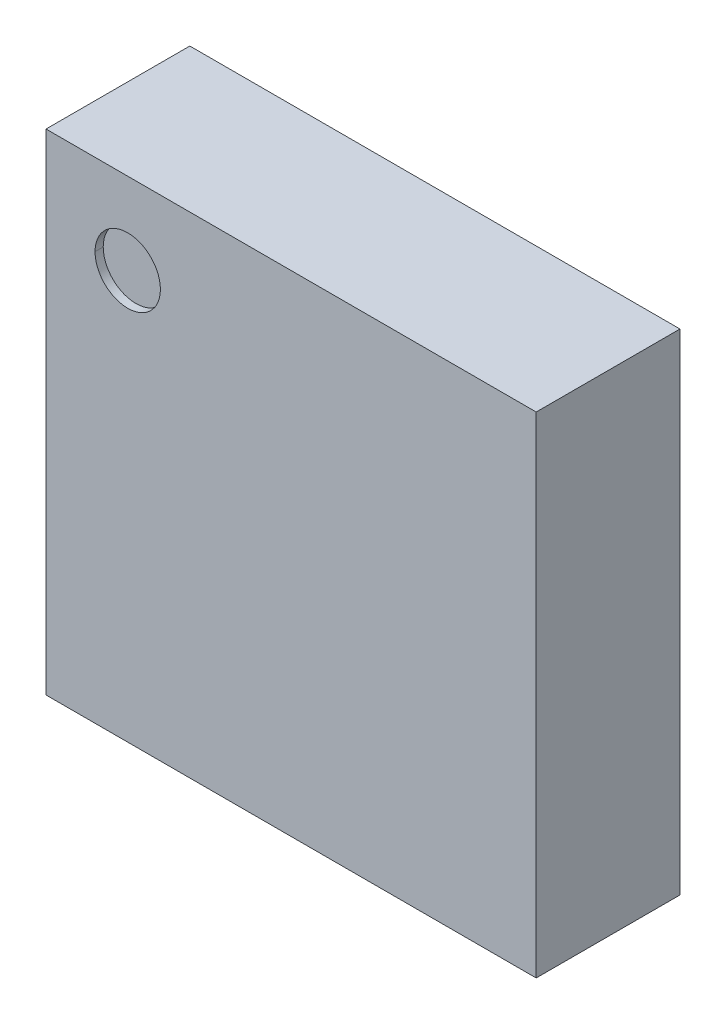
ISO-10303-21;
HEADER;
FILE_DESCRIPTION(('STEP AP214'),'2;1');
FILE_NAME('part.step','',(''),(''),'','','');
FILE_SCHEMA(('AUTOMOTIVE_DESIGN { 1 0 10303 214 1 1 1 1 }'));
ENDSEC;
DATA;
#1=APPLICATION_CONTEXT('core data for automotive mechanical design processes');
#2=APPLICATION_PROTOCOL_DEFINITION('international standard','automotive_design',2000,#1);
#3=PRODUCT_CONTEXT('',#1,'mechanical');
#4=PRODUCT('Part','Part','',(#3));
#5=PRODUCT_RELATED_PRODUCT_CATEGORY('part','',(#4));
#6=PRODUCT_DEFINITION_FORMATION('','',#4);
#7=PRODUCT_DEFINITION_CONTEXT('part definition',#1,'design');
#8=PRODUCT_DEFINITION('design','',#6,#7);
#9=PRODUCT_DEFINITION_SHAPE('','',#8);
#10=(LENGTH_UNIT() NAMED_UNIT(*) SI_UNIT(.MILLI.,.METRE.));
#11=(NAMED_UNIT(*) PLANE_ANGLE_UNIT() SI_UNIT($,.RADIAN.));
#12=(NAMED_UNIT(*) SI_UNIT($,.STERADIAN.) SOLID_ANGLE_UNIT());
#13=UNCERTAINTY_MEASURE_WITH_UNIT(LENGTH_MEASURE(1.E-05),#10,'distance_accuracy_value','');
#14=(GEOMETRIC_REPRESENTATION_CONTEXT(3) GLOBAL_UNCERTAINTY_ASSIGNED_CONTEXT((#13)) GLOBAL_UNIT_ASSIGNED_CONTEXT((#10,
#11,#12)) REPRESENTATION_CONTEXT('',''));
#15=CARTESIAN_POINT('',(0.,0.,0.));
#16=DIRECTION('',(0.,0.,1.));
#17=DIRECTION('',(1.,0.,0.));
#18=AXIS2_PLACEMENT_3D('',#15,#16,#17);
#19=CARTESIAN_POINT('',(-1.02832069959543,1.,0.85));
#20=DIRECTION('',(0.,0.,1.));
#21=DIRECTION('',(1.,0.,0.));
#22=AXIS2_PLACEMENT_3D('',#19,#20,#21);
#23=PLANE('',#22);
#24=CARTESIAN_POINT('',(-1.02832069959543,1.,0.85));
#25=DIRECTION('',(0.,0.,1.));
#26=DIRECTION('',(-1.,0.,0.));
#27=AXIS2_PLACEMENT_3D('',#24,#25,#26);
#28=CIRCLE('',#27,0.2);
#29=CARTESIAN_POINT('',(-1.22832069959544,1.,0.85));
#30=VERTEX_POINT('',#29);
#31=CARTESIAN_POINT('',(-0.828320699595435,1.,0.85));
#32=VERTEX_POINT('',#31);
#33=EDGE_CURVE('E103',#30,#32,#28,.T.);
#34=ORIENTED_EDGE('',*,*,#33,.T.);
#35=CARTESIAN_POINT('',(-1.02832069959543,1.,0.85));
#36=DIRECTION('',(0.,0.,1.));
#37=DIRECTION('',(-1.,0.,0.));
#38=AXIS2_PLACEMENT_3D('',#35,#36,#37);
#39=CIRCLE('',#38,0.2);
#40=EDGE_CURVE('E11',#32,#30,#39,.T.);
#41=ORIENTED_EDGE('',*,*,#40,.T.);
#42=EDGE_LOOP('',(#34,#41));
#43=FACE_BOUND('',#42,.T.);
#44=ADVANCED_FACE('F17',(#43),#23,.T.);
#45=CARTESIAN_POINT('',(-1.02832069959543,1.,0.85));
#46=DIRECTION('',(0.,0.,-1.));
#47=DIRECTION('',(-1.,0.,0.));
#48=AXIS2_PLACEMENT_3D('',#45,#46,#47);
#49=CYLINDRICAL_SURFACE('',#48,0.2);
#50=DIRECTION('',(0.,0.,-1.));
#51=VECTOR('',#50,1.);
#52=CARTESIAN_POINT('',(-0.828320699595435,1.,0.85));
#53=LINE('',#52,#51);
#54=CARTESIAN_POINT('',(-0.828320699595435,1.,0.9));
#55=VERTEX_POINT('',#54);
#56=EDGE_CURVE('E97',#55,#32,#53,.T.);
#57=ORIENTED_EDGE('',*,*,#56,.F.);
#58=CARTESIAN_POINT('',(-1.02832069959543,1.,0.9));
#59=DIRECTION('',(0.,0.,-1.));
#60=DIRECTION('',(-1.,0.,0.));
#61=AXIS2_PLACEMENT_3D('',#58,#59,#60);
#62=CIRCLE('',#61,0.2);
#63=CARTESIAN_POINT('',(-1.22832069959544,1.,0.9));
#64=VERTEX_POINT('',#63);
#65=EDGE_CURVE('E26',#64,#55,#62,.T.);
#66=ORIENTED_EDGE('',*,*,#65,.F.);
#67=DIRECTION('',(0.,0.,-1.));
#68=VECTOR('',#67,1.);
#69=CARTESIAN_POINT('',(-1.22832069959544,1.,0.85));
#70=LINE('',#69,#68);
#71=EDGE_CURVE('E106',#64,#30,#70,.T.);
#72=ORIENTED_EDGE('',*,*,#71,.T.);
#73=ORIENTED_EDGE('',*,*,#40,.F.);
#74=EDGE_LOOP('',(#57,#66,#72,#73));
#75=FACE_BOUND('',#74,.T.);
#76=ADVANCED_FACE('F98',(#75),#49,.F.);
#77=CARTESIAN_POINT('',(1.47167930040457,-1.5,0.9));
#78=DIRECTION('',(0.,0.,1.));
#79=DIRECTION('',(1.,0.,0.));
#80=AXIS2_PLACEMENT_3D('',#77,#78,#79);
#81=PLANE('',#80);
#82=ORIENTED_EDGE('',*,*,#65,.T.);
#83=CARTESIAN_POINT('',(-1.02832069959543,1.,0.9));
#84=DIRECTION('',(0.,0.,-1.));
#85=DIRECTION('',(-1.,0.,0.));
#86=AXIS2_PLACEMENT_3D('',#83,#84,#85);
#87=CIRCLE('',#86,0.2);
#88=EDGE_CURVE('E91',#55,#64,#87,.T.);
#89=ORIENTED_EDGE('',*,*,#88,.T.);
#90=EDGE_LOOP('',(#82,#89));
#91=FACE_BOUND('',#90,.T.);
#92=DIRECTION('',(1.,0.,0.));
#93=VECTOR('',#92,1.);
#94=CARTESIAN_POINT('',(-0.028320699595436,-1.5,0.9));
#95=LINE('',#94,#93);
#96=CARTESIAN_POINT('',(-1.52832069959544,-1.5,0.9));
#97=VERTEX_POINT('',#96);
#98=CARTESIAN_POINT('',(1.47167930040456,-1.5,0.9));
#99=VERTEX_POINT('',#98);
#100=EDGE_CURVE('E130',#97,#99,#95,.T.);
#101=ORIENTED_EDGE('',*,*,#100,.T.);
#102=DIRECTION('',(0.,1.,0.));
#103=VECTOR('',#102,1.);
#104=CARTESIAN_POINT('',(1.47167930040456,0.,0.9));
#105=LINE('',#104,#103);
#106=CARTESIAN_POINT('',(1.47167930040456,1.5,0.9));
#107=VERTEX_POINT('',#106);
#108=EDGE_CURVE('E146',#99,#107,#105,.T.);
#109=ORIENTED_EDGE('',*,*,#108,.T.);
#110=DIRECTION('',(1.,0.,0.));
#111=VECTOR('',#110,1.);
#112=CARTESIAN_POINT('',(-0.0283206995954357,1.5,0.9));
#113=LINE('',#112,#111);
#114=CARTESIAN_POINT('',(-1.52832069959544,1.5,0.9));
#115=VERTEX_POINT('',#114);
#116=EDGE_CURVE('E39',#115,#107,#113,.T.);
#117=ORIENTED_EDGE('',*,*,#116,.F.);
#118=DIRECTION('',(0.,1.,0.));
#119=VECTOR('',#118,1.);
#120=CARTESIAN_POINT('',(-1.52832069959544,0.,0.9));
#121=LINE('',#120,#119);
#122=EDGE_CURVE('E46',#97,#115,#121,.T.);
#123=ORIENTED_EDGE('',*,*,#122,.F.);
#124=EDGE_LOOP('',(#101,#109,#117,#123));
#125=FACE_BOUND('',#124,.T.);
#126=ADVANCED_FACE('F89',(#91,#125),#81,.T.);
#127=CARTESIAN_POINT('',(-0.0283206995954357,1.5,0.238538731150911));
#128=DIRECTION('',(0.,1.,0.));
#129=DIRECTION('',(0.,0.,-1.));
#130=AXIS2_PLACEMENT_3D('',#127,#128,#129);
#131=PLANE('',#130);
#132=DIRECTION('',(0.,0.,-1.));
#133=VECTOR('',#132,1.);
#134=CARTESIAN_POINT('',(1.47167930040456,1.5,0.238538731150911));
#135=LINE('',#134,#133);
#136=CARTESIAN_POINT('',(1.47167930040456,1.5,0.02));
#137=VERTEX_POINT('',#136);
#138=EDGE_CURVE('E137',#107,#137,#135,.T.);
#139=ORIENTED_EDGE('',*,*,#138,.T.);
#140=DIRECTION('',(-1.,0.,0.));
#141=VECTOR('',#140,1.);
#142=CARTESIAN_POINT('',(-0.028320699595436,1.5,0.02));
#143=LINE('',#142,#141);
#144=CARTESIAN_POINT('',(-1.52832069959544,1.5,0.02));
#145=VERTEX_POINT('',#144);
#146=EDGE_CURVE('E119',#137,#145,#143,.T.);
#147=ORIENTED_EDGE('',*,*,#146,.T.);
#148=DIRECTION('',(0.,0.,-1.));
#149=VECTOR('',#148,1.);
#150=CARTESIAN_POINT('',(-1.52832069959544,1.5,0.238538731150911));
#151=LINE('',#150,#149);
#152=EDGE_CURVE('E113',#115,#145,#151,.T.);
#153=ORIENTED_EDGE('',*,*,#152,.F.);
#154=ORIENTED_EDGE('',*,*,#116,.T.);
#155=EDGE_LOOP('',(#139,#147,#153,#154));
#156=FACE_BOUND('',#155,.T.);
#157=ADVANCED_FACE('F19',(#156),#131,.T.);
#158=CARTESIAN_POINT('',(-1.52832069959544,0.,0.238538731150911));
#159=DIRECTION('',(-1.,0.,0.));
#160=DIRECTION('',(0.,0.,1.));
#161=AXIS2_PLACEMENT_3D('',#158,#159,#160);
#162=PLANE('',#161);
#163=ORIENTED_EDGE('',*,*,#152,.T.);
#164=DIRECTION('',(0.,-1.,0.));
#165=VECTOR('',#164,1.);
#166=CARTESIAN_POINT('',(-1.52832069959544,0.,0.02));
#167=LINE('',#166,#165);
#168=CARTESIAN_POINT('',(-1.52832069959544,-1.5,0.02));
#169=VERTEX_POINT('',#168);
#170=EDGE_CURVE('E124',#145,#169,#167,.T.);
#171=ORIENTED_EDGE('',*,*,#170,.T.);
#172=DIRECTION('',(0.,0.,1.));
#173=VECTOR('',#172,1.);
#174=CARTESIAN_POINT('',(-1.52832069959544,-1.5,0.238538731150911));
#175=LINE('',#174,#173);
#176=EDGE_CURVE('E115',#169,#97,#175,.T.);
#177=ORIENTED_EDGE('',*,*,#176,.T.);
#178=ORIENTED_EDGE('',*,*,#122,.T.);
#179=EDGE_LOOP('',(#163,#171,#177,#178));
#180=FACE_BOUND('',#179,.T.);
#181=ADVANCED_FACE('F159',(#180),#162,.T.);
#182=CARTESIAN_POINT('',(-0.028320699595436,-1.5,0.238538731150911));
#183=DIRECTION('',(0.,1.,0.));
#184=DIRECTION('',(0.,0.,-1.));
#185=AXIS2_PLACEMENT_3D('',#182,#183,#184);
#186=PLANE('',#185);
#187=DIRECTION('',(0.,0.,1.));
#188=VECTOR('',#187,1.);
#189=CARTESIAN_POINT('',(1.47167930040456,-1.5,0.238538731150911));
#190=LINE('',#189,#188);
#191=CARTESIAN_POINT('',(1.47167930040456,-1.5,0.02));
#192=VERTEX_POINT('',#191);
#193=EDGE_CURVE('E133',#192,#99,#190,.T.);
#194=ORIENTED_EDGE('',*,*,#193,.T.);
#195=ORIENTED_EDGE('',*,*,#100,.F.);
#196=ORIENTED_EDGE('',*,*,#176,.F.);
#197=DIRECTION('',(1.,0.,0.));
#198=VECTOR('',#197,1.);
#199=CARTESIAN_POINT('',(-0.028320699595436,-1.5,0.02));
#200=LINE('',#199,#198);
#201=EDGE_CURVE('E127',#169,#192,#200,.T.);
#202=ORIENTED_EDGE('',*,*,#201,.T.);
#203=EDGE_LOOP('',(#194,#195,#196,#202));
#204=FACE_BOUND('',#203,.T.);
#205=ADVANCED_FACE('F164',(#204),#186,.F.);
#206=CARTESIAN_POINT('',(1.47167930040456,0.,0.238538731150911));
#207=DIRECTION('',(-1.,0.,0.));
#208=DIRECTION('',(0.,0.,1.));
#209=AXIS2_PLACEMENT_3D('',#206,#207,#208);
#210=PLANE('',#209);
#211=ORIENTED_EDGE('',*,*,#138,.F.);
#212=ORIENTED_EDGE('',*,*,#108,.F.);
#213=ORIENTED_EDGE('',*,*,#193,.F.);
#214=DIRECTION('',(0.,1.,0.));
#215=VECTOR('',#214,1.);
#216=CARTESIAN_POINT('',(1.47167930040456,0.,0.02));
#217=LINE('',#216,#215);
#218=EDGE_CURVE('E123',#192,#137,#217,.T.);
#219=ORIENTED_EDGE('',*,*,#218,.T.);
#220=EDGE_LOOP('',(#211,#212,#213,#219));
#221=FACE_BOUND('',#220,.T.);
#222=ADVANCED_FACE('F168',(#221),#210,.F.);
#223=CARTESIAN_POINT('',(-0.028320699595436,0.,0.02));
#224=DIRECTION('',(0.,0.,1.));
#225=DIRECTION('',(0.,-1.,0.));
#226=AXIS2_PLACEMENT_3D('',#223,#224,#225);
#227=PLANE('',#226);
#228=ORIENTED_EDGE('',*,*,#201,.F.);
#229=ORIENTED_EDGE('',*,*,#170,.F.);
#230=ORIENTED_EDGE('',*,*,#146,.F.);
#231=ORIENTED_EDGE('',*,*,#218,.F.);
#232=EDGE_LOOP('',(#228,#229,#230,#231));
#233=FACE_BOUND('',#232,.T.);
#234=ADVANCED_FACE('F173',(#233),#227,.F.);
#235=CARTESIAN_POINT('',(-1.02832069959543,1.,0.85));
#236=DIRECTION('',(0.,0.,-1.));
#237=DIRECTION('',(-1.,0.,0.));
#238=AXIS2_PLACEMENT_3D('',#235,#236,#237);
#239=CYLINDRICAL_SURFACE('',#238,0.2);
#240=ORIENTED_EDGE('',*,*,#88,.F.);
#241=ORIENTED_EDGE('',*,*,#56,.T.);
#242=ORIENTED_EDGE('',*,*,#33,.F.);
#243=ORIENTED_EDGE('',*,*,#71,.F.);
#244=EDGE_LOOP('',(#240,#241,#242,#243));
#245=FACE_BOUND('',#244,.T.);
#246=ADVANCED_FACE('F105',(#245),#239,.F.);
#247=CLOSED_SHELL('',(#44,#76,#126,#157,#181,#205,#222,#234,#246));
#248=MANIFOLD_SOLID_BREP('B1',#247);
#249=ADVANCED_BREP_SHAPE_REPRESENTATION('',(#18,#248),#14);
#250=SHAPE_DEFINITION_REPRESENTATION(#9,#249);
ENDSEC;
END-ISO-10303-21;
